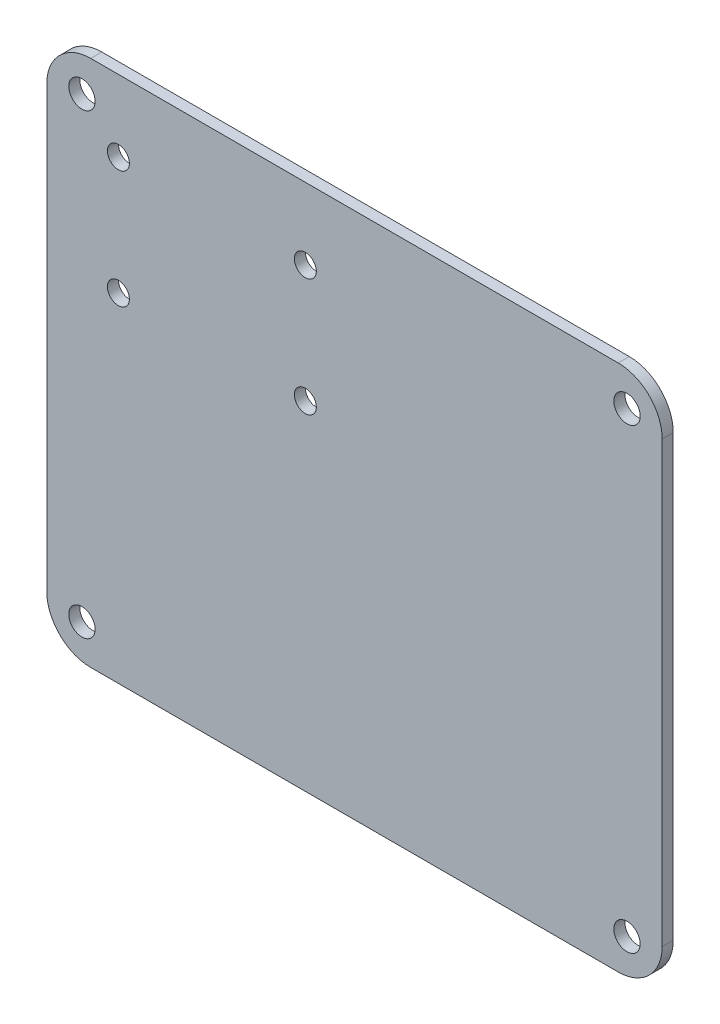
ISO-10303-21;
HEADER;
FILE_DESCRIPTION(('STEP AP214'),'2;1');
FILE_NAME('part.step','',(''),(''),'','','');
FILE_SCHEMA(('AUTOMOTIVE_DESIGN { 1 0 10303 214 1 1 1 1 }'));
ENDSEC;
DATA;
#1=APPLICATION_CONTEXT('core data for automotive mechanical design processes');
#2=APPLICATION_PROTOCOL_DEFINITION('international standard','automotive_design',2000,#1);
#3=PRODUCT_CONTEXT('',#1,'mechanical');
#4=PRODUCT('Part','Part','',(#3));
#5=PRODUCT_RELATED_PRODUCT_CATEGORY('part','',(#4));
#6=PRODUCT_DEFINITION_FORMATION('','',#4);
#7=PRODUCT_DEFINITION_CONTEXT('part definition',#1,'design');
#8=PRODUCT_DEFINITION('design','',#6,#7);
#9=PRODUCT_DEFINITION_SHAPE('','',#8);
#10=(LENGTH_UNIT() NAMED_UNIT(*) SI_UNIT(.MILLI.,.METRE.));
#11=(NAMED_UNIT(*) PLANE_ANGLE_UNIT() SI_UNIT($,.RADIAN.));
#12=(NAMED_UNIT(*) SI_UNIT($,.STERADIAN.) SOLID_ANGLE_UNIT());
#13=UNCERTAINTY_MEASURE_WITH_UNIT(LENGTH_MEASURE(1.E-05),#10,'distance_accuracy_value','');
#14=(GEOMETRIC_REPRESENTATION_CONTEXT(3) GLOBAL_UNCERTAINTY_ASSIGNED_CONTEXT((#13)) GLOBAL_UNIT_ASSIGNED_CONTEXT((#10,
#11,#12)) REPRESENTATION_CONTEXT('',''));
#15=CARTESIAN_POINT('',(0.,0.,0.));
#16=DIRECTION('',(0.,0.,1.));
#17=DIRECTION('',(1.,0.,0.));
#18=AXIS2_PLACEMENT_3D('',#15,#16,#17);
#19=CARTESIAN_POINT('',(-15.4904788230241,-8.03685752491666,1.6));
#20=DIRECTION('',(1.,0.,0.));
#21=DIRECTION('',(0.,0.,-1.));
#22=AXIS2_PLACEMENT_3D('',#19,#20,#21);
#23=PLANE('',#22);
#24=DIRECTION('',(0.,-1.,0.));
#25=VECTOR('',#24,1.);
#26=CARTESIAN_POINT('',(-15.4904788230241,-8.03685752491666,0.));
#27=LINE('',#26,#25);
#28=CARTESIAN_POINT('',(-15.4904788230241,61.8131424750833,0.));
#29=VERTEX_POINT('',#28);
#30=CARTESIAN_POINT('',(-15.4904788230241,-1.68685752491666,0.));
#31=VERTEX_POINT('',#30);
#32=EDGE_CURVE('E158',#29,#31,#27,.T.);
#33=ORIENTED_EDGE('',*,*,#32,.T.);
#34=DIRECTION('',(0.,0.,-1.));
#35=VECTOR('',#34,1.);
#36=CARTESIAN_POINT('',(-15.4904788230241,-1.68685752491666,1.6));
#37=LINE('',#36,#35);
#38=CARTESIAN_POINT('',(-15.4904788230241,-1.68685752491666,1.6));
#39=VERTEX_POINT('',#38);
#40=EDGE_CURVE('E11',#31,#39,#37,.F.);
#41=ORIENTED_EDGE('',*,*,#40,.T.);
#42=DIRECTION('',(0.,-1.,0.));
#43=VECTOR('',#42,1.);
#44=CARTESIAN_POINT('',(-15.4904788230241,-8.03685752491666,1.6));
#45=LINE('',#44,#43);
#46=CARTESIAN_POINT('',(-15.4904788230241,61.8131424750833,1.6));
#47=VERTEX_POINT('',#46);
#48=EDGE_CURVE('E126',#47,#39,#45,.T.);
#49=ORIENTED_EDGE('',*,*,#48,.F.);
#50=DIRECTION('',(0.,0.,-1.));
#51=VECTOR('',#50,1.);
#52=CARTESIAN_POINT('',(-15.4904788230241,61.8131424750833,1.6));
#53=LINE('',#52,#51);
#54=EDGE_CURVE('E42',#47,#29,#53,.T.);
#55=ORIENTED_EDGE('',*,*,#54,.T.);
#56=EDGE_LOOP('',(#33,#41,#49,#55));
#57=FACE_BOUND('',#56,.T.);
#58=ADVANCED_FACE('F34',(#57),#23,.F.);
#59=CARTESIAN_POINT('',(-15.4904788230241,-8.03685752491666,1.6));
#60=DIRECTION('',(0.,1.,0.));
#61=DIRECTION('',(0.,0.,1.));
#62=AXIS2_PLACEMENT_3D('',#59,#60,#61);
#63=PLANE('',#62);
#64=DIRECTION('',(1.,0.,0.));
#65=VECTOR('',#64,1.);
#66=CARTESIAN_POINT('',(-15.4904788230241,-8.03685752491666,0.));
#67=LINE('',#66,#65);
#68=CARTESIAN_POINT('',(-9.14047882302413,-8.03685752491666,0.));
#69=VERTEX_POINT('',#68);
#70=CARTESIAN_POINT('',(67.0595211769759,-8.03685752491666,0.));
#71=VERTEX_POINT('',#70);
#72=EDGE_CURVE('E131',#69,#71,#67,.T.);
#73=ORIENTED_EDGE('',*,*,#72,.T.);
#74=DIRECTION('',(0.,0.,-1.));
#75=VECTOR('',#74,1.);
#76=CARTESIAN_POINT('',(67.0595211769759,-8.03685752491666,1.6));
#77=LINE('',#76,#75);
#78=CARTESIAN_POINT('',(67.0595211769759,-8.03685752491666,1.6));
#79=VERTEX_POINT('',#78);
#80=EDGE_CURVE('E49',#71,#79,#77,.F.);
#81=ORIENTED_EDGE('',*,*,#80,.T.);
#82=DIRECTION('',(1.,0.,0.));
#83=VECTOR('',#82,1.);
#84=CARTESIAN_POINT('',(-15.4904788230241,-8.03685752491666,1.6));
#85=LINE('',#84,#83);
#86=CARTESIAN_POINT('',(-9.14047882302413,-8.03685752491666,1.6));
#87=VERTEX_POINT('',#86);
#88=EDGE_CURVE('E129',#87,#79,#85,.T.);
#89=ORIENTED_EDGE('',*,*,#88,.F.);
#90=DIRECTION('',(0.,0.,-1.));
#91=VECTOR('',#90,1.);
#92=CARTESIAN_POINT('',(-9.14047882302413,-8.03685752491666,1.6));
#93=LINE('',#92,#91);
#94=EDGE_CURVE('E150',#87,#69,#93,.T.);
#95=ORIENTED_EDGE('',*,*,#94,.T.);
#96=EDGE_LOOP('',(#73,#81,#89,#95));
#97=FACE_BOUND('',#96,.T.);
#98=ADVANCED_FACE('F259',(#97),#63,.F.);
#99=CARTESIAN_POINT('',(73.4095211769759,-8.03685752491666,1.6));
#100=DIRECTION('',(-1.,0.,0.));
#101=DIRECTION('',(0.,0.,1.));
#102=AXIS2_PLACEMENT_3D('',#99,#100,#101);
#103=PLANE('',#102);
#104=DIRECTION('',(0.,1.,0.));
#105=VECTOR('',#104,1.);
#106=CARTESIAN_POINT('',(73.4095211769759,-8.03685752491666,0.));
#107=LINE('',#106,#105);
#108=CARTESIAN_POINT('',(73.4095211769759,-1.68685752491666,0.));
#109=VERTEX_POINT('',#108);
#110=CARTESIAN_POINT('',(73.4095211769759,61.8131424750833,0.));
#111=VERTEX_POINT('',#110);
#112=EDGE_CURVE('E127',#109,#111,#107,.T.);
#113=ORIENTED_EDGE('',*,*,#112,.T.);
#114=DIRECTION('',(0.,0.,-1.));
#115=VECTOR('',#114,1.);
#116=CARTESIAN_POINT('',(73.4095211769759,61.8131424750833,1.6));
#117=LINE('',#116,#115);
#118=CARTESIAN_POINT('',(73.4095211769759,61.8131424750833,1.6));
#119=VERTEX_POINT('',#118);
#120=EDGE_CURVE('E105',#111,#119,#117,.F.);
#121=ORIENTED_EDGE('',*,*,#120,.T.);
#122=DIRECTION('',(0.,1.,0.));
#123=VECTOR('',#122,1.);
#124=CARTESIAN_POINT('',(73.4095211769759,-8.03685752491666,1.6));
#125=LINE('',#124,#123);
#126=CARTESIAN_POINT('',(73.4095211769759,-1.68685752491666,1.6));
#127=VERTEX_POINT('',#126);
#128=EDGE_CURVE('E170',#127,#119,#125,.T.);
#129=ORIENTED_EDGE('',*,*,#128,.F.);
#130=DIRECTION('',(0.,0.,-1.));
#131=VECTOR('',#130,1.);
#132=CARTESIAN_POINT('',(73.4095211769759,-1.68685752491666,1.6));
#133=LINE('',#132,#131);
#134=EDGE_CURVE('E110',#127,#109,#133,.T.);
#135=ORIENTED_EDGE('',*,*,#134,.T.);
#136=EDGE_LOOP('',(#113,#121,#129,#135));
#137=FACE_BOUND('',#136,.T.);
#138=ADVANCED_FACE('F264',(#137),#103,.F.);
#139=CARTESIAN_POINT('',(-15.4904788230241,68.1631424750833,1.6));
#140=DIRECTION('',(0.,-1.,0.));
#141=DIRECTION('',(0.,0.,-1.));
#142=AXIS2_PLACEMENT_3D('',#139,#140,#141);
#143=PLANE('',#142);
#144=DIRECTION('',(-1.,0.,0.));
#145=VECTOR('',#144,1.);
#146=CARTESIAN_POINT('',(-15.4904788230241,68.1631424750833,1.6));
#147=LINE('',#146,#145);
#148=CARTESIAN_POINT('',(67.0595211769759,68.1631424750833,1.6));
#149=VERTEX_POINT('',#148);
#150=CARTESIAN_POINT('',(-9.14047882302413,68.1631424750833,1.6));
#151=VERTEX_POINT('',#150);
#152=EDGE_CURVE('E120',#149,#151,#147,.T.);
#153=ORIENTED_EDGE('',*,*,#152,.F.);
#154=DIRECTION('',(0.,0.,-1.));
#155=VECTOR('',#154,1.);
#156=CARTESIAN_POINT('',(67.0595211769759,68.1631424750833,1.6));
#157=LINE('',#156,#155);
#158=CARTESIAN_POINT('',(67.0595211769759,68.1631424750833,0.));
#159=VERTEX_POINT('',#158);
#160=EDGE_CURVE('E104',#149,#159,#157,.T.);
#161=ORIENTED_EDGE('',*,*,#160,.T.);
#162=DIRECTION('',(-1.,0.,0.));
#163=VECTOR('',#162,1.);
#164=CARTESIAN_POINT('',(-15.4904788230241,68.1631424750833,0.));
#165=LINE('',#164,#163);
#166=CARTESIAN_POINT('',(-9.14047882302413,68.1631424750833,0.));
#167=VERTEX_POINT('',#166);
#168=EDGE_CURVE('E117',#159,#167,#165,.T.);
#169=ORIENTED_EDGE('',*,*,#168,.T.);
#170=DIRECTION('',(0.,0.,-1.));
#171=VECTOR('',#170,1.);
#172=CARTESIAN_POINT('',(-9.14047882302413,68.1631424750833,1.6));
#173=LINE('',#172,#171);
#174=EDGE_CURVE('E122',#167,#151,#173,.F.);
#175=ORIENTED_EDGE('',*,*,#174,.T.);
#176=EDGE_LOOP('',(#153,#161,#169,#175));
#177=FACE_BOUND('',#176,.T.);
#178=ADVANCED_FACE('F116',(#177),#143,.F.);
#179=CARTESIAN_POINT('',(0.,0.,1.6));
#180=DIRECTION('',(0.,0.,-1.));
#181=DIRECTION('',(-1.,0.,0.));
#182=AXIS2_PLACEMENT_3D('',#179,#180,#181);
#183=PLANE('',#182);
#184=CARTESIAN_POINT('',(-10.4104788230241,-2.95685752491665,1.6));
#185=DIRECTION('',(0.,0.,-1.));
#186=DIRECTION('',(1.,0.,0.));
#187=AXIS2_PLACEMENT_3D('',#184,#185,#186);
#188=CIRCLE('',#187,1.905);
#189=CARTESIAN_POINT('',(-8.50547882302412,-2.95685752491665,1.6));
#190=VERTEX_POINT('',#189);
#191=EDGE_CURVE('E204',#190,#190,#188,.T.);
#192=ORIENTED_EDGE('',*,*,#191,.T.);
#193=EDGE_LOOP('',(#192));
#194=FACE_BOUND('',#193,.T.);
#195=CARTESIAN_POINT('',(68.3295211769759,-2.95685752491663,1.6));
#196=DIRECTION('',(0.,0.,-1.));
#197=DIRECTION('',(-1.,0.,0.));
#198=AXIS2_PLACEMENT_3D('',#195,#196,#197);
#199=CIRCLE('',#198,1.90500000000001);
#200=CARTESIAN_POINT('',(66.4245211769759,-2.95685752491663,1.6));
#201=VERTEX_POINT('',#200);
#202=EDGE_CURVE('E210',#201,#201,#199,.T.);
#203=ORIENTED_EDGE('',*,*,#202,.T.);
#204=EDGE_LOOP('',(#203));
#205=FACE_BOUND('',#204,.T.);
#206=CARTESIAN_POINT('',(68.3295211769759,63.0831424750833,1.6));
#207=DIRECTION('',(0.,0.,-1.));
#208=DIRECTION('',(1.,0.,0.));
#209=AXIS2_PLACEMENT_3D('',#206,#207,#208);
#210=CIRCLE('',#209,1.90500000000001);
#211=CARTESIAN_POINT('',(70.2345211769759,63.0831424750833,1.6));
#212=VERTEX_POINT('',#211);
#213=EDGE_CURVE('E198',#212,#212,#210,.T.);
#214=ORIENTED_EDGE('',*,*,#213,.T.);
#215=EDGE_LOOP('',(#214));
#216=FACE_BOUND('',#215,.T.);
#217=CARTESIAN_POINT('',(-10.4104788230241,63.0831424750834,1.6));
#218=DIRECTION('',(0.,0.,-1.));
#219=DIRECTION('',(-1.,0.,0.));
#220=AXIS2_PLACEMENT_3D('',#217,#218,#219);
#221=CIRCLE('',#220,1.905);
#222=CARTESIAN_POINT('',(-12.3154788230241,63.0831424750834,1.6));
#223=VERTEX_POINT('',#222);
#224=EDGE_CURVE('E181',#223,#223,#221,.T.);
#225=ORIENTED_EDGE('',*,*,#224,.T.);
#226=EDGE_LOOP('',(#225));
#227=FACE_BOUND('',#226,.T.);
#228=CARTESIAN_POINT('',(-5.14047882302414,40.8131424750834,1.6));
#229=DIRECTION('',(0.,0.,-1.));
#230=DIRECTION('',(-1.,0.,0.));
#231=AXIS2_PLACEMENT_3D('',#228,#229,#230);
#232=CIRCLE('',#231,1.58750000000001);
#233=CARTESIAN_POINT('',(-6.72797882302416,40.8131424750834,1.6));
#234=VERTEX_POINT('',#233);
#235=EDGE_CURVE('E180',#234,#234,#232,.T.);
#236=ORIENTED_EDGE('',*,*,#235,.T.);
#237=EDGE_LOOP('',(#236));
#238=FACE_BOUND('',#237,.T.);
#239=CARTESIAN_POINT('',(21.8595211769759,40.8131424750833,1.6));
#240=DIRECTION('',(0.,0.,-1.));
#241=DIRECTION('',(-1.,0.,0.));
#242=AXIS2_PLACEMENT_3D('',#239,#240,#241);
#243=CIRCLE('',#242,1.5875);
#244=CARTESIAN_POINT('',(20.2720211769759,40.8131424750833,1.6));
#245=VERTEX_POINT('',#244);
#246=EDGE_CURVE('E187',#245,#245,#243,.T.);
#247=ORIENTED_EDGE('',*,*,#246,.T.);
#248=EDGE_LOOP('',(#247));
#249=FACE_BOUND('',#248,.T.);
#250=CARTESIAN_POINT('',(21.8595211769759,57.8131424750833,1.6));
#251=DIRECTION('',(0.,0.,-1.));
#252=DIRECTION('',(-1.,0.,0.));
#253=AXIS2_PLACEMENT_3D('',#250,#251,#252);
#254=CIRCLE('',#253,1.5875);
#255=CARTESIAN_POINT('',(20.2720211769759,57.8131424750833,1.6));
#256=VERTEX_POINT('',#255);
#257=EDGE_CURVE('E175',#256,#256,#254,.T.);
#258=ORIENTED_EDGE('',*,*,#257,.T.);
#259=EDGE_LOOP('',(#258));
#260=FACE_BOUND('',#259,.T.);
#261=CARTESIAN_POINT('',(-5.14047882302413,57.8131424750834,1.6));
#262=DIRECTION('',(0.,0.,-1.));
#263=DIRECTION('',(-1.,0.,0.));
#264=AXIS2_PLACEMENT_3D('',#261,#262,#263);
#265=CIRCLE('',#264,1.5875);
#266=CARTESIAN_POINT('',(-6.72797882302413,57.8131424750834,1.6));
#267=VERTEX_POINT('',#266);
#268=EDGE_CURVE('E163',#267,#267,#265,.T.);
#269=ORIENTED_EDGE('',*,*,#268,.T.);
#270=EDGE_LOOP('',(#269));
#271=FACE_BOUND('',#270,.T.);
#272=ORIENTED_EDGE('',*,*,#128,.T.);
#273=CARTESIAN_POINT('',(67.0595211769759,61.8131424750833,1.6));
#274=DIRECTION('',(0.,0.,-1.));
#275=DIRECTION('',(-1.,0.,0.));
#276=AXIS2_PLACEMENT_3D('',#273,#274,#275);
#277=CIRCLE('',#276,6.35);
#278=EDGE_CURVE('E148',#119,#149,#277,.F.);
#279=ORIENTED_EDGE('',*,*,#278,.T.);
#280=ORIENTED_EDGE('',*,*,#152,.T.);
#281=CARTESIAN_POINT('',(-9.14047882302413,61.8131424750833,1.6));
#282=DIRECTION('',(0.,0.,-1.));
#283=DIRECTION('',(-1.,0.,0.));
#284=AXIS2_PLACEMENT_3D('',#281,#282,#283);
#285=CIRCLE('',#284,6.35);
#286=EDGE_CURVE('E143',#151,#47,#285,.F.);
#287=ORIENTED_EDGE('',*,*,#286,.T.);
#288=ORIENTED_EDGE('',*,*,#48,.T.);
#289=CARTESIAN_POINT('',(-9.14047882302413,-1.68685752491666,1.6));
#290=DIRECTION('',(0.,0.,-1.));
#291=DIRECTION('',(-1.,0.,0.));
#292=AXIS2_PLACEMENT_3D('',#289,#290,#291);
#293=CIRCLE('',#292,6.35);
#294=EDGE_CURVE('E56',#39,#87,#293,.F.);
#295=ORIENTED_EDGE('',*,*,#294,.T.);
#296=ORIENTED_EDGE('',*,*,#88,.T.);
#297=CARTESIAN_POINT('',(67.0595211769759,-1.68685752491666,1.6));
#298=DIRECTION('',(0.,0.,-1.));
#299=DIRECTION('',(-1.,0.,0.));
#300=AXIS2_PLACEMENT_3D('',#297,#298,#299);
#301=CIRCLE('',#300,6.35);
#302=EDGE_CURVE('E146',#79,#127,#301,.F.);
#303=ORIENTED_EDGE('',*,*,#302,.T.);
#304=EDGE_LOOP('',(#272,#279,#280,#287,#288,#295,#296,#303));
#305=FACE_BOUND('',#304,.T.);
#306=ADVANCED_FACE('F219',(#194,#205,#216,#227,#238,#249,#260,#271,#305),#183,.F.);
#307=CARTESIAN_POINT('',(0.,0.,0.));
#308=DIRECTION('',(0.,0.,-1.));
#309=DIRECTION('',(-1.,0.,0.));
#310=AXIS2_PLACEMENT_3D('',#307,#308,#309);
#311=PLANE('',#310);
#312=CARTESIAN_POINT('',(-10.4104788230241,-2.95685752491665,0.));
#313=DIRECTION('',(0.,0.,-1.));
#314=DIRECTION('',(1.,0.,0.));
#315=AXIS2_PLACEMENT_3D('',#312,#313,#314);
#316=CIRCLE('',#315,1.905);
#317=CARTESIAN_POINT('',(-8.50547882302412,-2.95685752491665,0.));
#318=VERTEX_POINT('',#317);
#319=EDGE_CURVE('E201',#318,#318,#316,.T.);
#320=ORIENTED_EDGE('',*,*,#319,.F.);
#321=EDGE_LOOP('',(#320));
#322=FACE_BOUND('',#321,.T.);
#323=CARTESIAN_POINT('',(68.3295211769759,-2.95685752491663,0.));
#324=DIRECTION('',(0.,0.,-1.));
#325=DIRECTION('',(-1.,0.,0.));
#326=AXIS2_PLACEMENT_3D('',#323,#324,#325);
#327=CIRCLE('',#326,1.90500000000001);
#328=CARTESIAN_POINT('',(66.4245211769759,-2.95685752491663,0.));
#329=VERTEX_POINT('',#328);
#330=EDGE_CURVE('E207',#329,#329,#327,.T.);
#331=ORIENTED_EDGE('',*,*,#330,.F.);
#332=EDGE_LOOP('',(#331));
#333=FACE_BOUND('',#332,.T.);
#334=CARTESIAN_POINT('',(68.3295211769759,63.0831424750833,0.));
#335=DIRECTION('',(0.,0.,-1.));
#336=DIRECTION('',(1.,0.,0.));
#337=AXIS2_PLACEMENT_3D('',#334,#335,#336);
#338=CIRCLE('',#337,1.90500000000001);
#339=CARTESIAN_POINT('',(70.2345211769759,63.0831424750833,0.));
#340=VERTEX_POINT('',#339);
#341=EDGE_CURVE('E213',#340,#340,#338,.T.);
#342=ORIENTED_EDGE('',*,*,#341,.F.);
#343=EDGE_LOOP('',(#342));
#344=FACE_BOUND('',#343,.T.);
#345=CARTESIAN_POINT('',(-10.4104788230241,63.0831424750834,0.));
#346=DIRECTION('',(0.,0.,-1.));
#347=DIRECTION('',(-1.,0.,0.));
#348=AXIS2_PLACEMENT_3D('',#345,#346,#347);
#349=CIRCLE('',#348,1.905);
#350=CARTESIAN_POINT('',(-12.3154788230241,63.0831424750834,0.));
#351=VERTEX_POINT('',#350);
#352=EDGE_CURVE('E195',#351,#351,#349,.T.);
#353=ORIENTED_EDGE('',*,*,#352,.F.);
#354=EDGE_LOOP('',(#353));
#355=FACE_BOUND('',#354,.T.);
#356=CARTESIAN_POINT('',(-5.14047882302414,40.8131424750834,0.));
#357=DIRECTION('',(0.,0.,-1.));
#358=DIRECTION('',(-1.,0.,0.));
#359=AXIS2_PLACEMENT_3D('',#356,#357,#358);
#360=CIRCLE('',#359,1.58750000000001);
#361=CARTESIAN_POINT('',(-6.72797882302416,40.8131424750834,0.));
#362=VERTEX_POINT('',#361);
#363=EDGE_CURVE('E177',#362,#362,#360,.T.);
#364=ORIENTED_EDGE('',*,*,#363,.F.);
#365=EDGE_LOOP('',(#364));
#366=FACE_BOUND('',#365,.T.);
#367=CARTESIAN_POINT('',(21.8595211769759,40.8131424750833,0.));
#368=DIRECTION('',(0.,0.,-1.));
#369=DIRECTION('',(-1.,0.,0.));
#370=AXIS2_PLACEMENT_3D('',#367,#368,#369);
#371=CIRCLE('',#370,1.5875);
#372=CARTESIAN_POINT('',(20.2720211769759,40.8131424750833,0.));
#373=VERTEX_POINT('',#372);
#374=EDGE_CURVE('E184',#373,#373,#371,.T.);
#375=ORIENTED_EDGE('',*,*,#374,.F.);
#376=EDGE_LOOP('',(#375));
#377=FACE_BOUND('',#376,.T.);
#378=CARTESIAN_POINT('',(21.8595211769759,57.8131424750833,0.));
#379=DIRECTION('',(0.,0.,-1.));
#380=DIRECTION('',(-1.,0.,0.));
#381=AXIS2_PLACEMENT_3D('',#378,#379,#380);
#382=CIRCLE('',#381,1.5875);
#383=CARTESIAN_POINT('',(20.2720211769759,57.8131424750833,0.));
#384=VERTEX_POINT('',#383);
#385=EDGE_CURVE('E190',#384,#384,#382,.T.);
#386=ORIENTED_EDGE('',*,*,#385,.F.);
#387=EDGE_LOOP('',(#386));
#388=FACE_BOUND('',#387,.T.);
#389=CARTESIAN_POINT('',(-5.14047882302413,57.8131424750834,0.));
#390=DIRECTION('',(0.,0.,-1.));
#391=DIRECTION('',(-1.,0.,0.));
#392=AXIS2_PLACEMENT_3D('',#389,#390,#391);
#393=CIRCLE('',#392,1.5875);
#394=CARTESIAN_POINT('',(-6.72797882302413,57.8131424750834,0.));
#395=VERTEX_POINT('',#394);
#396=EDGE_CURVE('E166',#395,#395,#393,.T.);
#397=ORIENTED_EDGE('',*,*,#396,.F.);
#398=EDGE_LOOP('',(#397));
#399=FACE_BOUND('',#398,.T.);
#400=ORIENTED_EDGE('',*,*,#168,.F.);
#401=CARTESIAN_POINT('',(67.0595211769759,61.8131424750833,0.));
#402=DIRECTION('',(0.,0.,-1.));
#403=DIRECTION('',(-1.,0.,0.));
#404=AXIS2_PLACEMENT_3D('',#401,#402,#403);
#405=CIRCLE('',#404,6.35);
#406=EDGE_CURVE('E100',#159,#111,#405,.T.);
#407=ORIENTED_EDGE('',*,*,#406,.T.);
#408=ORIENTED_EDGE('',*,*,#112,.F.);
#409=CARTESIAN_POINT('',(67.0595211769759,-1.68685752491666,0.));
#410=DIRECTION('',(0.,0.,-1.));
#411=DIRECTION('',(-1.,0.,0.));
#412=AXIS2_PLACEMENT_3D('',#409,#410,#411);
#413=CIRCLE('',#412,6.35);
#414=EDGE_CURVE('E111',#109,#71,#413,.T.);
#415=ORIENTED_EDGE('',*,*,#414,.T.);
#416=ORIENTED_EDGE('',*,*,#72,.F.);
#417=CARTESIAN_POINT('',(-9.14047882302413,-1.68685752491666,0.));
#418=DIRECTION('',(0.,0.,-1.));
#419=DIRECTION('',(-1.,0.,0.));
#420=AXIS2_PLACEMENT_3D('',#417,#418,#419);
#421=CIRCLE('',#420,6.35);
#422=EDGE_CURVE('E137',#69,#31,#421,.T.);
#423=ORIENTED_EDGE('',*,*,#422,.T.);
#424=ORIENTED_EDGE('',*,*,#32,.F.);
#425=CARTESIAN_POINT('',(-9.14047882302413,61.8131424750833,0.));
#426=DIRECTION('',(0.,0.,-1.));
#427=DIRECTION('',(-1.,0.,0.));
#428=AXIS2_PLACEMENT_3D('',#425,#426,#427);
#429=CIRCLE('',#428,6.35);
#430=EDGE_CURVE('E121',#29,#167,#429,.T.);
#431=ORIENTED_EDGE('',*,*,#430,.T.);
#432=EDGE_LOOP('',(#400,#407,#408,#415,#416,#423,#424,#431));
#433=FACE_BOUND('',#432,.T.);
#434=ADVANCED_FACE('F124',(#322,#333,#344,#355,#366,#377,#388,#399,#433),#311,.T.);
#435=CARTESIAN_POINT('',(-5.14047882302413,57.8131424750834,1.6));
#436=DIRECTION('',(0.,0.,-1.));
#437=DIRECTION('',(-1.,0.,0.));
#438=AXIS2_PLACEMENT_3D('',#435,#436,#437);
#439=CYLINDRICAL_SURFACE('',#438,1.5875);
#440=ORIENTED_EDGE('',*,*,#268,.F.);
#441=EDGE_LOOP('',(#440));
#442=FACE_BOUND('',#441,.T.);
#443=ORIENTED_EDGE('',*,*,#396,.T.);
#444=EDGE_LOOP('',(#443));
#445=FACE_BOUND('',#444,.T.);
#446=ADVANCED_FACE('F232',(#442,#445),#439,.F.);
#447=CARTESIAN_POINT('',(21.8595211769759,57.8131424750833,1.6));
#448=DIRECTION('',(0.,0.,-1.));
#449=DIRECTION('',(-1.,0.,0.));
#450=AXIS2_PLACEMENT_3D('',#447,#448,#449);
#451=CYLINDRICAL_SURFACE('',#450,1.5875);
#452=ORIENTED_EDGE('',*,*,#257,.F.);
#453=EDGE_LOOP('',(#452));
#454=FACE_BOUND('',#453,.T.);
#455=ORIENTED_EDGE('',*,*,#385,.T.);
#456=EDGE_LOOP('',(#455));
#457=FACE_BOUND('',#456,.T.);
#458=ADVANCED_FACE('F246',(#454,#457),#451,.F.);
#459=CARTESIAN_POINT('',(21.8595211769759,40.8131424750833,1.6));
#460=DIRECTION('',(0.,0.,-1.));
#461=DIRECTION('',(-1.,0.,0.));
#462=AXIS2_PLACEMENT_3D('',#459,#460,#461);
#463=CYLINDRICAL_SURFACE('',#462,1.5875);
#464=ORIENTED_EDGE('',*,*,#246,.F.);
#465=EDGE_LOOP('',(#464));
#466=FACE_BOUND('',#465,.T.);
#467=ORIENTED_EDGE('',*,*,#374,.T.);
#468=EDGE_LOOP('',(#467));
#469=FACE_BOUND('',#468,.T.);
#470=ADVANCED_FACE('F252',(#466,#469),#463,.F.);
#471=CARTESIAN_POINT('',(-5.14047882302414,40.8131424750834,1.6));
#472=DIRECTION('',(0.,0.,-1.));
#473=DIRECTION('',(-1.,0.,0.));
#474=AXIS2_PLACEMENT_3D('',#471,#472,#473);
#475=CYLINDRICAL_SURFACE('',#474,1.58750000000001);
#476=ORIENTED_EDGE('',*,*,#235,.F.);
#477=EDGE_LOOP('',(#476));
#478=FACE_BOUND('',#477,.T.);
#479=ORIENTED_EDGE('',*,*,#363,.T.);
#480=EDGE_LOOP('',(#479));
#481=FACE_BOUND('',#480,.T.);
#482=ADVANCED_FACE('F363',(#478,#481),#475,.F.);
#483=CARTESIAN_POINT('',(-10.4104788230241,63.0831424750834,1.6));
#484=DIRECTION('',(0.,0.,-1.));
#485=DIRECTION('',(-1.,0.,0.));
#486=AXIS2_PLACEMENT_3D('',#483,#484,#485);
#487=CYLINDRICAL_SURFACE('',#486,1.905);
#488=ORIENTED_EDGE('',*,*,#224,.F.);
#489=EDGE_LOOP('',(#488));
#490=FACE_BOUND('',#489,.T.);
#491=ORIENTED_EDGE('',*,*,#352,.T.);
#492=EDGE_LOOP('',(#491));
#493=FACE_BOUND('',#492,.T.);
#494=ADVANCED_FACE('F226',(#490,#493),#487,.F.);
#495=CARTESIAN_POINT('',(68.3295211769759,63.0831424750833,1.6));
#496=DIRECTION('',(0.,0.,-1.));
#497=DIRECTION('',(-1.,0.,0.));
#498=AXIS2_PLACEMENT_3D('',#495,#496,#497);
#499=CYLINDRICAL_SURFACE('',#498,1.90500000000001);
#500=ORIENTED_EDGE('',*,*,#213,.F.);
#501=EDGE_LOOP('',(#500));
#502=FACE_BOUND('',#501,.T.);
#503=ORIENTED_EDGE('',*,*,#341,.T.);
#504=EDGE_LOOP('',(#503));
#505=FACE_BOUND('',#504,.T.);
#506=ADVANCED_FACE('F222',(#502,#505),#499,.F.);
#507=CARTESIAN_POINT('',(68.3295211769759,-2.95685752491663,1.6));
#508=DIRECTION('',(0.,0.,-1.));
#509=DIRECTION('',(-1.,0.,0.));
#510=AXIS2_PLACEMENT_3D('',#507,#508,#509);
#511=CYLINDRICAL_SURFACE('',#510,1.90500000000001);
#512=ORIENTED_EDGE('',*,*,#202,.F.);
#513=EDGE_LOOP('',(#512));
#514=FACE_BOUND('',#513,.T.);
#515=ORIENTED_EDGE('',*,*,#330,.T.);
#516=EDGE_LOOP('',(#515));
#517=FACE_BOUND('',#516,.T.);
#518=ADVANCED_FACE('F225',(#514,#517),#511,.F.);
#519=CARTESIAN_POINT('',(-10.4104788230241,-2.95685752491665,1.6));
#520=DIRECTION('',(0.,0.,-1.));
#521=DIRECTION('',(-1.,0.,0.));
#522=AXIS2_PLACEMENT_3D('',#519,#520,#521);
#523=CYLINDRICAL_SURFACE('',#522,1.905);
#524=ORIENTED_EDGE('',*,*,#191,.F.);
#525=EDGE_LOOP('',(#524));
#526=FACE_BOUND('',#525,.T.);
#527=ORIENTED_EDGE('',*,*,#319,.T.);
#528=EDGE_LOOP('',(#527));
#529=FACE_BOUND('',#528,.T.);
#530=ADVANCED_FACE('F271',(#526,#529),#523,.F.);
#531=CARTESIAN_POINT('',(67.0595211769759,61.8131424750833,1.6));
#532=DIRECTION('',(0.,0.,-1.));
#533=DIRECTION('',(-1.,0.,0.));
#534=AXIS2_PLACEMENT_3D('',#531,#532,#533);
#535=CYLINDRICAL_SURFACE('',#534,6.35);
#536=ORIENTED_EDGE('',*,*,#278,.F.);
#537=ORIENTED_EDGE('',*,*,#120,.F.);
#538=ORIENTED_EDGE('',*,*,#406,.F.);
#539=ORIENTED_EDGE('',*,*,#160,.F.);
#540=EDGE_LOOP('',(#536,#537,#538,#539));
#541=FACE_BOUND('',#540,.T.);
#542=ADVANCED_FACE('F103',(#541),#535,.T.);
#543=CARTESIAN_POINT('',(67.0595211769759,-1.68685752491666,1.6));
#544=DIRECTION('',(0.,0.,-1.));
#545=DIRECTION('',(-1.,0.,0.));
#546=AXIS2_PLACEMENT_3D('',#543,#544,#545);
#547=CYLINDRICAL_SURFACE('',#546,6.35);
#548=ORIENTED_EDGE('',*,*,#302,.F.);
#549=ORIENTED_EDGE('',*,*,#80,.F.);
#550=ORIENTED_EDGE('',*,*,#414,.F.);
#551=ORIENTED_EDGE('',*,*,#134,.F.);
#552=EDGE_LOOP('',(#548,#549,#550,#551));
#553=FACE_BOUND('',#552,.T.);
#554=ADVANCED_FACE('F270',(#553),#547,.T.);
#555=CARTESIAN_POINT('',(-9.14047882302413,-1.68685752491666,1.6));
#556=DIRECTION('',(0.,0.,-1.));
#557=DIRECTION('',(-1.,0.,0.));
#558=AXIS2_PLACEMENT_3D('',#555,#556,#557);
#559=CYLINDRICAL_SURFACE('',#558,6.35);
#560=ORIENTED_EDGE('',*,*,#294,.F.);
#561=ORIENTED_EDGE('',*,*,#40,.F.);
#562=ORIENTED_EDGE('',*,*,#422,.F.);
#563=ORIENTED_EDGE('',*,*,#94,.F.);
#564=EDGE_LOOP('',(#560,#561,#562,#563));
#565=FACE_BOUND('',#564,.T.);
#566=ADVANCED_FACE('F273',(#565),#559,.T.);
#567=CARTESIAN_POINT('',(-9.14047882302413,61.8131424750833,1.6));
#568=DIRECTION('',(0.,0.,-1.));
#569=DIRECTION('',(-1.,0.,0.));
#570=AXIS2_PLACEMENT_3D('',#567,#568,#569);
#571=CYLINDRICAL_SURFACE('',#570,6.35);
#572=ORIENTED_EDGE('',*,*,#286,.F.);
#573=ORIENTED_EDGE('',*,*,#174,.F.);
#574=ORIENTED_EDGE('',*,*,#430,.F.);
#575=ORIENTED_EDGE('',*,*,#54,.F.);
#576=EDGE_LOOP('',(#572,#573,#574,#575));
#577=FACE_BOUND('',#576,.T.);
#578=ADVANCED_FACE('F36',(#577),#571,.T.);
#579=CLOSED_SHELL('',(#58,#98,#138,#178,#306,#434,#446,#458,#470,#482,#494,#506,#518,#530,#542,
#554,#566,#578));
#580=MANIFOLD_SOLID_BREP('B2',#579);
#581=ADVANCED_BREP_SHAPE_REPRESENTATION('',(#18,#580),#14);
#582=SHAPE_DEFINITION_REPRESENTATION(#9,#581);
ENDSEC;
END-ISO-10303-21;
